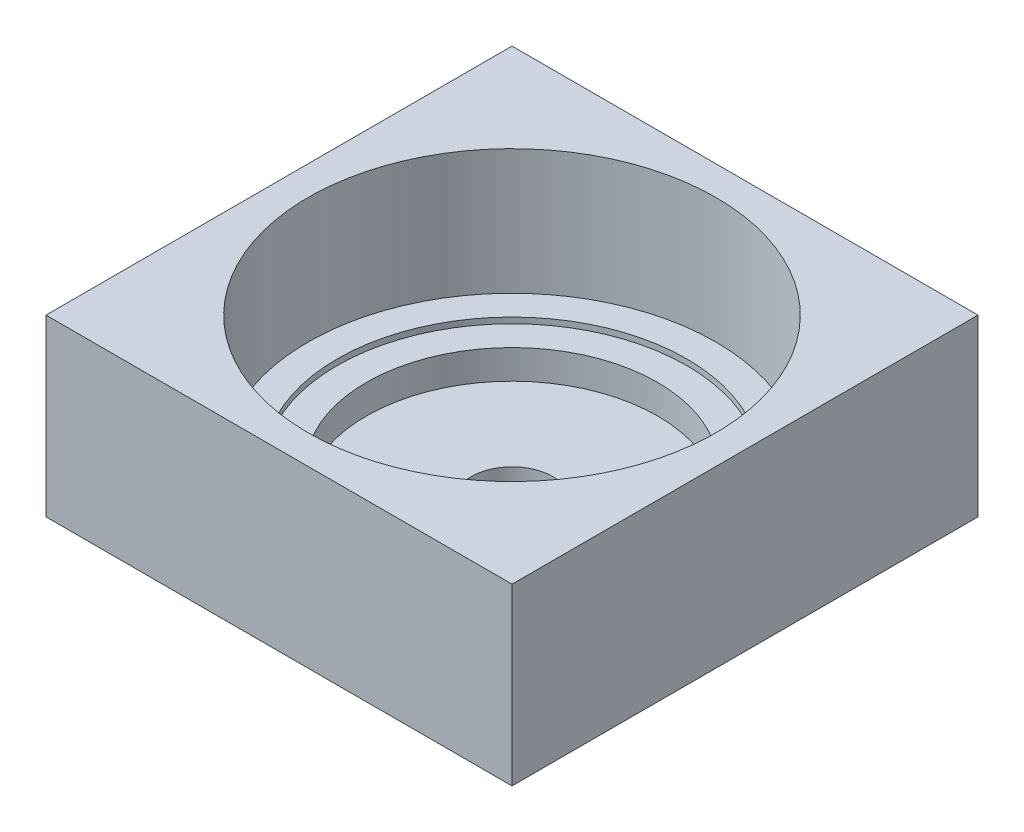
ISO-10303-21;
HEADER;
FILE_DESCRIPTION(('STEP AP214'),'2;1');
FILE_NAME('part.step','',(''),(''),'','','');
FILE_SCHEMA(('AUTOMOTIVE_DESIGN { 1 0 10303 214 1 1 1 1 }'));
ENDSEC;
DATA;
#1=APPLICATION_CONTEXT('core data for automotive mechanical design processes');
#2=APPLICATION_PROTOCOL_DEFINITION('international standard','automotive_design',2000,#1);
#3=PRODUCT_CONTEXT('',#1,'mechanical');
#4=PRODUCT('Part','Part','',(#3));
#5=PRODUCT_RELATED_PRODUCT_CATEGORY('part','',(#4));
#6=PRODUCT_DEFINITION_FORMATION('','',#4);
#7=PRODUCT_DEFINITION_CONTEXT('part definition',#1,'design');
#8=PRODUCT_DEFINITION('design','',#6,#7);
#9=PRODUCT_DEFINITION_SHAPE('','',#8);
#10=(LENGTH_UNIT() NAMED_UNIT(*) SI_UNIT(.MILLI.,.METRE.));
#11=(NAMED_UNIT(*) PLANE_ANGLE_UNIT() SI_UNIT($,.RADIAN.));
#12=(NAMED_UNIT(*) SI_UNIT($,.STERADIAN.) SOLID_ANGLE_UNIT());
#13=UNCERTAINTY_MEASURE_WITH_UNIT(LENGTH_MEASURE(1.E-05),#10,'distance_accuracy_value','');
#14=(GEOMETRIC_REPRESENTATION_CONTEXT(3) GLOBAL_UNCERTAINTY_ASSIGNED_CONTEXT((#13)) GLOBAL_UNIT_ASSIGNED_CONTEXT((#10,
#11,#12)) REPRESENTATION_CONTEXT('',''));
#15=CARTESIAN_POINT('',(0.,0.,0.));
#16=DIRECTION('',(0.,0.,1.));
#17=DIRECTION('',(1.,0.,0.));
#18=AXIS2_PLACEMENT_3D('',#15,#16,#17);
#19=CARTESIAN_POINT('',(0.,0.,0.));
#20=DIRECTION('',(0.,-1.,0.));
#21=DIRECTION('',(0.,0.,-1.));
#22=AXIS2_PLACEMENT_3D('',#19,#20,#21);
#23=CYLINDRICAL_SURFACE('',#22,60.);
#24=CARTESIAN_POINT('',(0.,17.,0.));
#25=DIRECTION('',(0.,-1.,0.));
#26=DIRECTION('',(0.,0.,-1.));
#27=AXIS2_PLACEMENT_3D('',#24,#25,#26);
#28=CIRCLE('',#27,60.);
#29=CARTESIAN_POINT('',(0.,17.,-60.));
#30=VERTEX_POINT('',#29);
#31=EDGE_CURVE('E100',#30,#30,#28,.F.);
#32=ORIENTED_EDGE('',*,*,#31,.T.);
#33=EDGE_LOOP('',(#32));
#34=FACE_BOUND('',#33,.T.);
#35=CARTESIAN_POINT('',(0.,15.,0.));
#36=DIRECTION('',(0.,-1.,0.));
#37=DIRECTION('',(0.,0.,-1.));
#38=AXIS2_PLACEMENT_3D('',#35,#36,#37);
#39=CIRCLE('',#38,60.);
#40=CARTESIAN_POINT('',(0.,15.,-60.));
#41=VERTEX_POINT('',#40);
#42=EDGE_CURVE('E18',#41,#41,#39,.T.);
#43=ORIENTED_EDGE('',*,*,#42,.T.);
#44=EDGE_LOOP('',(#43));
#45=FACE_BOUND('',#44,.T.);
#46=ADVANCED_FACE('F15',(#34,#45),#23,.F.);
#47=CARTESIAN_POINT('',(50.,15.,0.));
#48=DIRECTION('',(0.,-1.,0.));
#49=DIRECTION('',(0.,0.,-1.));
#50=AXIS2_PLACEMENT_3D('',#47,#48,#49);
#51=PLANE('',#50);
#52=CARTESIAN_POINT('',(0.,15.,0.));
#53=DIRECTION('',(0.,-1.,0.));
#54=DIRECTION('',(0.,0.,-1.));
#55=AXIS2_PLACEMENT_3D('',#52,#53,#54);
#56=CIRCLE('',#55,50.);
#57=CARTESIAN_POINT('',(0.,15.,-50.));
#58=VERTEX_POINT('',#57);
#59=EDGE_CURVE('E98',#58,#58,#56,.T.);
#60=ORIENTED_EDGE('',*,*,#59,.T.);
#61=EDGE_LOOP('',(#60));
#62=FACE_BOUND('',#61,.T.);
#63=ORIENTED_EDGE('',*,*,#42,.F.);
#64=EDGE_LOOP('',(#63));
#65=FACE_BOUND('',#64,.T.);
#66=ADVANCED_FACE('F108',(#62,#65),#51,.F.);
#67=CARTESIAN_POINT('',(60.,17.,0.));
#68=DIRECTION('',(0.,-1.,0.));
#69=DIRECTION('',(0.,0.,-1.));
#70=AXIS2_PLACEMENT_3D('',#67,#68,#69);
#71=PLANE('',#70);
#72=ORIENTED_EDGE('',*,*,#31,.F.);
#73=EDGE_LOOP('',(#72));
#74=FACE_BOUND('',#73,.T.);
#75=CARTESIAN_POINT('',(0.,17.,0.));
#76=DIRECTION('',(0.,-1.,0.));
#77=DIRECTION('',(0.,0.,-1.));
#78=AXIS2_PLACEMENT_3D('',#75,#76,#77);
#79=CIRCLE('',#78,70.);
#80=CARTESIAN_POINT('',(0.,17.,-70.));
#81=VERTEX_POINT('',#80);
#82=EDGE_CURVE('E95',#81,#81,#79,.F.);
#83=ORIENTED_EDGE('',*,*,#82,.T.);
#84=EDGE_LOOP('',(#83));
#85=FACE_BOUND('',#84,.T.);
#86=ADVANCED_FACE('F110',(#74,#85),#71,.F.);
#87=CARTESIAN_POINT('',(0.,0.,0.));
#88=DIRECTION('',(0.,-1.,0.));
#89=DIRECTION('',(0.,0.,-1.));
#90=AXIS2_PLACEMENT_3D('',#87,#88,#89);
#91=CYLINDRICAL_SURFACE('',#90,50.);
#92=ORIENTED_EDGE('',*,*,#59,.F.);
#93=EDGE_LOOP('',(#92));
#94=FACE_BOUND('',#93,.T.);
#95=CARTESIAN_POINT('',(0.,5.,0.));
#96=DIRECTION('',(0.,-1.,0.));
#97=DIRECTION('',(0.,0.,-1.));
#98=AXIS2_PLACEMENT_3D('',#95,#96,#97);
#99=CIRCLE('',#98,50.);
#100=CARTESIAN_POINT('',(0.,5.,-50.));
#101=VERTEX_POINT('',#100);
#102=EDGE_CURVE('E92',#101,#101,#99,.T.);
#103=ORIENTED_EDGE('',*,*,#102,.T.);
#104=EDGE_LOOP('',(#103));
#105=FACE_BOUND('',#104,.T.);
#106=ADVANCED_FACE('F117',(#94,#105),#91,.F.);
#107=CARTESIAN_POINT('',(0.,0.,0.));
#108=DIRECTION('',(0.,-1.,0.));
#109=DIRECTION('',(0.,0.,-1.));
#110=AXIS2_PLACEMENT_3D('',#107,#108,#109);
#111=CYLINDRICAL_SURFACE('',#110,70.);
#112=CARTESIAN_POINT('',(0.,60.,0.));
#113=DIRECTION('',(0.,-1.,0.));
#114=DIRECTION('',(0.,0.,-1.));
#115=AXIS2_PLACEMENT_3D('',#112,#113,#114);
#116=CIRCLE('',#115,70.);
#117=CARTESIAN_POINT('',(0.,60.,-70.));
#118=VERTEX_POINT('',#117);
#119=EDGE_CURVE('E89',#118,#118,#116,.F.);
#120=ORIENTED_EDGE('',*,*,#119,.T.);
#121=EDGE_LOOP('',(#120));
#122=FACE_BOUND('',#121,.T.);
#123=ORIENTED_EDGE('',*,*,#82,.F.);
#124=EDGE_LOOP('',(#123));
#125=FACE_BOUND('',#124,.T.);
#126=ADVANCED_FACE('F149',(#122,#125),#111,.F.);
#127=CARTESIAN_POINT('',(14.,5.,0.));
#128=DIRECTION('',(0.,-1.,0.));
#129=DIRECTION('',(0.,0.,-1.));
#130=AXIS2_PLACEMENT_3D('',#127,#128,#129);
#131=PLANE('',#130);
#132=CARTESIAN_POINT('',(0.,5.,0.));
#133=DIRECTION('',(0.,-1.,0.));
#134=DIRECTION('',(0.,0.,-1.));
#135=AXIS2_PLACEMENT_3D('',#132,#133,#134);
#136=CIRCLE('',#135,14.);
#137=CARTESIAN_POINT('',(0.,5.,-14.));
#138=VERTEX_POINT('',#137);
#139=EDGE_CURVE('E72',#138,#138,#136,.T.);
#140=ORIENTED_EDGE('',*,*,#139,.T.);
#141=EDGE_LOOP('',(#140));
#142=FACE_BOUND('',#141,.T.);
#143=ORIENTED_EDGE('',*,*,#102,.F.);
#144=EDGE_LOOP('',(#143));
#145=FACE_BOUND('',#144,.T.);
#146=ADVANCED_FACE('F146',(#142,#145),#131,.F.);
#147=CARTESIAN_POINT('',(0.,60.,0.));
#148=DIRECTION('',(0.,-1.,0.));
#149=DIRECTION('',(0.,0.,-1.));
#150=AXIS2_PLACEMENT_3D('',#147,#148,#149);
#151=PLANE('',#150);
#152=DIRECTION('',(1.,0.,0.));
#153=VECTOR('',#152,1.);
#154=CARTESIAN_POINT('',(-80.,60.,-80.));
#155=LINE('',#154,#153);
#156=CARTESIAN_POINT('',(80.,60.,-80.));
#157=VERTEX_POINT('',#156);
#158=CARTESIAN_POINT('',(-80.,60.,-80.));
#159=VERTEX_POINT('',#158);
#160=EDGE_CURVE('E253',#157,#159,#155,.F.);
#161=ORIENTED_EDGE('',*,*,#160,.T.);
#162=DIRECTION('',(0.,0.,-1.));
#163=VECTOR('',#162,1.);
#164=CARTESIAN_POINT('',(-80.,60.,80.));
#165=LINE('',#164,#163);
#166=CARTESIAN_POINT('',(-80.,60.,80.));
#167=VERTEX_POINT('',#166);
#168=EDGE_CURVE('E53',#159,#167,#165,.F.);
#169=ORIENTED_EDGE('',*,*,#168,.T.);
#170=DIRECTION('',(-1.,0.,0.));
#171=VECTOR('',#170,1.);
#172=CARTESIAN_POINT('',(-80.,60.,80.));
#173=LINE('',#172,#171);
#174=CARTESIAN_POINT('',(80.,60.,80.));
#175=VERTEX_POINT('',#174);
#176=EDGE_CURVE('E55',#167,#175,#173,.F.);
#177=ORIENTED_EDGE('',*,*,#176,.T.);
#178=DIRECTION('',(0.,0.,1.));
#179=VECTOR('',#178,1.);
#180=CARTESIAN_POINT('',(80.,60.,80.));
#181=LINE('',#180,#179);
#182=EDGE_CURVE('E59',#175,#157,#181,.F.);
#183=ORIENTED_EDGE('',*,*,#182,.T.);
#184=EDGE_LOOP('',(#161,#169,#177,#183));
#185=FACE_BOUND('',#184,.T.);
#186=ORIENTED_EDGE('',*,*,#119,.F.);
#187=EDGE_LOOP('',(#186));
#188=FACE_BOUND('',#187,.T.);
#189=ADVANCED_FACE('F57',(#185,#188),#151,.F.);
#190=CARTESIAN_POINT('',(0.,0.,0.));
#191=DIRECTION('',(0.,-1.,0.));
#192=DIRECTION('',(0.,0.,-1.));
#193=AXIS2_PLACEMENT_3D('',#190,#191,#192);
#194=CYLINDRICAL_SURFACE('',#193,14.);
#195=CARTESIAN_POINT('',(0.,0.,0.));
#196=DIRECTION('',(0.,-1.,0.));
#197=DIRECTION('',(0.,0.,-1.));
#198=AXIS2_PLACEMENT_3D('',#195,#196,#197);
#199=CIRCLE('',#198,14.);
#200=CARTESIAN_POINT('',(0.,0.,-14.));
#201=VERTEX_POINT('',#200);
#202=EDGE_CURVE('E83',#201,#201,#199,.F.);
#203=ORIENTED_EDGE('',*,*,#202,.F.);
#204=EDGE_LOOP('',(#203));
#205=FACE_BOUND('',#204,.T.);
#206=ORIENTED_EDGE('',*,*,#139,.F.);
#207=EDGE_LOOP('',(#206));
#208=FACE_BOUND('',#207,.T.);
#209=ADVANCED_FACE('F140',(#205,#208),#194,.F.);
#210=CARTESIAN_POINT('',(80.,60.,80.));
#211=DIRECTION('',(-1.,0.,0.));
#212=DIRECTION('',(0.,0.,1.));
#213=AXIS2_PLACEMENT_3D('',#210,#211,#212);
#214=PLANE('',#213);
#215=DIRECTION('',(0.,1.,0.));
#216=VECTOR('',#215,1.);
#217=CARTESIAN_POINT('',(80.,60.,-80.));
#218=LINE('',#217,#216);
#219=CARTESIAN_POINT('',(80.,0.,-80.));
#220=VERTEX_POINT('',#219);
#221=EDGE_CURVE('E70',#220,#157,#218,.T.);
#222=ORIENTED_EDGE('',*,*,#221,.T.);
#223=ORIENTED_EDGE('',*,*,#182,.F.);
#224=DIRECTION('',(0.,1.,0.));
#225=VECTOR('',#224,1.);
#226=CARTESIAN_POINT('',(80.,60.,80.));
#227=LINE('',#226,#225);
#228=CARTESIAN_POINT('',(80.,0.,80.));
#229=VERTEX_POINT('',#228);
#230=EDGE_CURVE('E64',#175,#229,#227,.F.);
#231=ORIENTED_EDGE('',*,*,#230,.T.);
#232=DIRECTION('',(0.,0.,-1.));
#233=VECTOR('',#232,1.);
#234=CARTESIAN_POINT('',(80.,0.,0.));
#235=LINE('',#234,#233);
#236=EDGE_CURVE('E86',#220,#229,#235,.F.);
#237=ORIENTED_EDGE('',*,*,#236,.F.);
#238=EDGE_LOOP('',(#222,#223,#231,#237));
#239=FACE_BOUND('',#238,.T.);
#240=ADVANCED_FACE('F67',(#239),#214,.F.);
#241=CARTESIAN_POINT('',(-80.,60.,80.));
#242=DIRECTION('',(0.,0.,-1.));
#243=DIRECTION('',(-1.,0.,0.));
#244=AXIS2_PLACEMENT_3D('',#241,#242,#243);
#245=PLANE('',#244);
#246=ORIENTED_EDGE('',*,*,#230,.F.);
#247=ORIENTED_EDGE('',*,*,#176,.F.);
#248=DIRECTION('',(0.,1.,0.));
#249=VECTOR('',#248,1.);
#250=CARTESIAN_POINT('',(-80.,60.,80.));
#251=LINE('',#250,#249);
#252=CARTESIAN_POINT('',(-80.,0.,80.));
#253=VERTEX_POINT('',#252);
#254=EDGE_CURVE('E79',#167,#253,#251,.F.);
#255=ORIENTED_EDGE('',*,*,#254,.T.);
#256=DIRECTION('',(1.,0.,0.));
#257=VECTOR('',#256,1.);
#258=CARTESIAN_POINT('',(0.,0.,80.));
#259=LINE('',#258,#257);
#260=EDGE_CURVE('E76',#229,#253,#259,.F.);
#261=ORIENTED_EDGE('',*,*,#260,.F.);
#262=EDGE_LOOP('',(#246,#247,#255,#261));
#263=FACE_BOUND('',#262,.T.);
#264=ADVANCED_FACE('F74',(#263),#245,.F.);
#265=CARTESIAN_POINT('',(-80.,60.,80.));
#266=DIRECTION('',(1.,0.,0.));
#267=DIRECTION('',(0.,0.,-1.));
#268=AXIS2_PLACEMENT_3D('',#265,#266,#267);
#269=PLANE('',#268);
#270=ORIENTED_EDGE('',*,*,#254,.F.);
#271=ORIENTED_EDGE('',*,*,#168,.F.);
#272=DIRECTION('',(0.,1.,0.));
#273=VECTOR('',#272,1.);
#274=CARTESIAN_POINT('',(-80.,60.,-80.));
#275=LINE('',#274,#273);
#276=CARTESIAN_POINT('',(-80.,0.,-80.));
#277=VERTEX_POINT('',#276);
#278=EDGE_CURVE('E33',#159,#277,#275,.F.);
#279=ORIENTED_EDGE('',*,*,#278,.T.);
#280=DIRECTION('',(0.,0.,-1.));
#281=VECTOR('',#280,1.);
#282=CARTESIAN_POINT('',(-80.,0.,0.));
#283=LINE('',#282,#281);
#284=EDGE_CURVE('E24',#253,#277,#283,.T.);
#285=ORIENTED_EDGE('',*,*,#284,.F.);
#286=EDGE_LOOP('',(#270,#271,#279,#285));
#287=FACE_BOUND('',#286,.T.);
#288=ADVANCED_FACE('F128',(#287),#269,.F.);
#289=CARTESIAN_POINT('',(-80.,60.,-80.));
#290=DIRECTION('',(0.,0.,1.));
#291=DIRECTION('',(1.,0.,0.));
#292=AXIS2_PLACEMENT_3D('',#289,#290,#291);
#293=PLANE('',#292);
#294=ORIENTED_EDGE('',*,*,#278,.F.);
#295=ORIENTED_EDGE('',*,*,#160,.F.);
#296=ORIENTED_EDGE('',*,*,#221,.F.);
#297=DIRECTION('',(1.,0.,0.));
#298=VECTOR('',#297,1.);
#299=CARTESIAN_POINT('',(0.,0.,-80.));
#300=LINE('',#299,#298);
#301=EDGE_CURVE('E10',#277,#220,#300,.T.);
#302=ORIENTED_EDGE('',*,*,#301,.F.);
#303=EDGE_LOOP('',(#294,#295,#296,#302));
#304=FACE_BOUND('',#303,.T.);
#305=ADVANCED_FACE('F122',(#304),#293,.F.);
#306=CARTESIAN_POINT('',(0.,0.,0.));
#307=DIRECTION('',(0.,-1.,0.));
#308=DIRECTION('',(0.,0.,-1.));
#309=AXIS2_PLACEMENT_3D('',#306,#307,#308);
#310=PLANE('',#309);
#311=ORIENTED_EDGE('',*,*,#284,.T.);
#312=ORIENTED_EDGE('',*,*,#301,.T.);
#313=ORIENTED_EDGE('',*,*,#236,.T.);
#314=ORIENTED_EDGE('',*,*,#260,.T.);
#315=EDGE_LOOP('',(#311,#312,#313,#314));
#316=FACE_BOUND('',#315,.T.);
#317=ORIENTED_EDGE('',*,*,#202,.T.);
#318=EDGE_LOOP('',(#317));
#319=FACE_BOUND('',#318,.T.);
#320=ADVANCED_FACE('F120',(#316,#319),#310,.T.);
#321=CLOSED_SHELL('',(#46,#66,#86,#106,#126,#146,#189,#209,#240,#264,#288,#305,#320));
#322=MANIFOLD_SOLID_BREP('B1',#321);
#323=ADVANCED_BREP_SHAPE_REPRESENTATION('',(#18,#322),#14);
#324=SHAPE_DEFINITION_REPRESENTATION(#9,#323);
ENDSEC;
END-ISO-10303-21;
